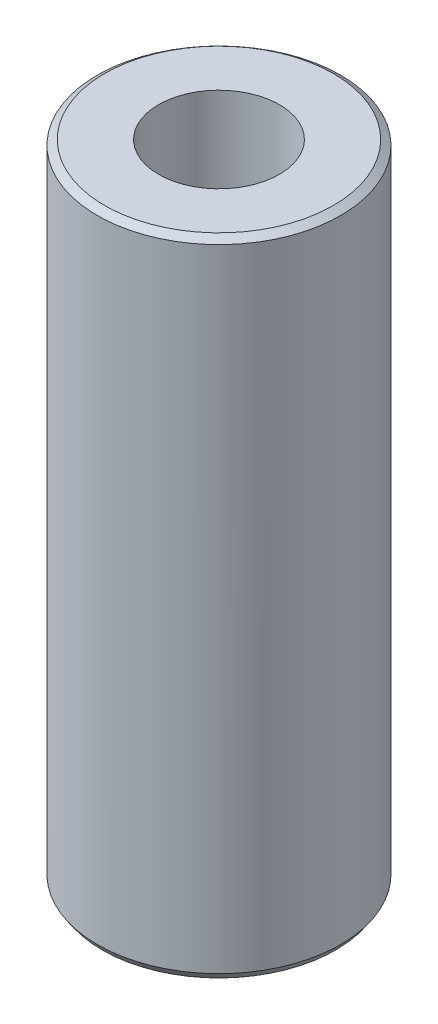
ISO-10303-21;
HEADER;
FILE_DESCRIPTION(('STEP AP214'),'2;1');
FILE_NAME('part.step','',(''),(''),'','','');
FILE_SCHEMA(('AUTOMOTIVE_DESIGN { 1 0 10303 214 1 1 1 1 }'));
ENDSEC;
DATA;
#1=APPLICATION_CONTEXT('core data for automotive mechanical design processes');
#2=APPLICATION_PROTOCOL_DEFINITION('international standard','automotive_design',2000,#1);
#3=PRODUCT_CONTEXT('',#1,'mechanical');
#4=PRODUCT('Part','Part','',(#3));
#5=PRODUCT_RELATED_PRODUCT_CATEGORY('part','',(#4));
#6=PRODUCT_DEFINITION_FORMATION('','',#4);
#7=PRODUCT_DEFINITION_CONTEXT('part definition',#1,'design');
#8=PRODUCT_DEFINITION('design','',#6,#7);
#9=PRODUCT_DEFINITION_SHAPE('','',#8);
#10=(LENGTH_UNIT() NAMED_UNIT(*) SI_UNIT(.MILLI.,.METRE.));
#11=(NAMED_UNIT(*) PLANE_ANGLE_UNIT() SI_UNIT($,.RADIAN.));
#12=(NAMED_UNIT(*) SI_UNIT($,.STERADIAN.) SOLID_ANGLE_UNIT());
#13=UNCERTAINTY_MEASURE_WITH_UNIT(LENGTH_MEASURE(1.E-05),#10,'distance_accuracy_value','');
#14=(GEOMETRIC_REPRESENTATION_CONTEXT(3) GLOBAL_UNCERTAINTY_ASSIGNED_CONTEXT((#13)) GLOBAL_UNIT_ASSIGNED_CONTEXT((#10,
#11,#12)) REPRESENTATION_CONTEXT('',''));
#15=CARTESIAN_POINT('',(0.,0.,0.));
#16=DIRECTION('',(0.,0.,1.));
#17=DIRECTION('',(1.,0.,0.));
#18=AXIS2_PLACEMENT_3D('',#15,#16,#17);
#19=CARTESIAN_POINT('',(0.,26.4578086175618,0.));
#20=DIRECTION('',(0.,-1.,0.));
#21=DIRECTION('',(0.,0.,-1.));
#22=AXIS2_PLACEMENT_3D('',#19,#20,#21);
#23=CYLINDRICAL_SURFACE('',#22,5.);
#24=CARTESIAN_POINT('',(0.,26.2505846226853,0.));
#25=DIRECTION('',(0.,1.,0.));
#26=DIRECTION('',(0.,0.,1.));
#27=AXIS2_PLACEMENT_3D('',#24,#25,#26);
#28=CIRCLE('',#27,5.);
#29=CARTESIAN_POINT('',(0.,26.2505846226853,-5.));
#30=VERTEX_POINT('',#29);
#31=EDGE_CURVE('E50',#30,#30,#28,.F.);
#32=ORIENTED_EDGE('',*,*,#31,.T.);
#33=EDGE_LOOP('',(#32));
#34=FACE_BOUND('',#33,.T.);
#35=CARTESIAN_POINT('',(0.,0.299683460139807,0.));
#36=DIRECTION('',(0.,1.,0.));
#37=DIRECTION('',(0.,0.,1.));
#38=AXIS2_PLACEMENT_3D('',#35,#36,#37);
#39=CIRCLE('',#38,5.);
#40=CARTESIAN_POINT('',(0.,0.299683460139807,5.));
#41=VERTEX_POINT('',#40);
#42=EDGE_CURVE('E51',#41,#41,#39,.T.);
#43=ORIENTED_EDGE('',*,*,#42,.T.);
#44=EDGE_LOOP('',(#43));
#45=FACE_BOUND('',#44,.T.);
#46=ADVANCED_FACE('F39',(#34,#45),#23,.T.);
#47=CARTESIAN_POINT('',(0.,26.4578086175618,0.));
#48=DIRECTION('',(0.,1.,0.));
#49=DIRECTION('',(0.,0.,1.));
#50=AXIS2_PLACEMENT_3D('',#47,#48,#49);
#51=PLANE('',#50);
#52=CARTESIAN_POINT('',(0.,26.4578086175618,0.));
#53=DIRECTION('',(0.,1.,0.));
#54=DIRECTION('',(0.,0.,1.));
#55=AXIS2_PLACEMENT_3D('',#52,#53,#54);
#56=CIRCLE('',#55,4.70031653986019);
#57=CARTESIAN_POINT('',(0.,26.4578086175618,-4.70031653986019));
#58=VERTEX_POINT('',#57);
#59=EDGE_CURVE('E54',#58,#58,#56,.T.);
#60=ORIENTED_EDGE('',*,*,#59,.T.);
#61=EDGE_LOOP('',(#60));
#62=FACE_BOUND('',#61,.T.);
#63=CARTESIAN_POINT('',(0.,26.4578086175618,0.));
#64=DIRECTION('',(0.,1.,0.));
#65=DIRECTION('',(0.,0.,1.));
#66=AXIS2_PLACEMENT_3D('',#63,#64,#65);
#67=CIRCLE('',#66,2.48332849350975);
#68=CARTESIAN_POINT('',(0.,26.4578086175618,2.48332849350975));
#69=VERTEX_POINT('',#68);
#70=EDGE_CURVE('E58',#69,#69,#67,.T.);
#71=ORIENTED_EDGE('',*,*,#70,.F.);
#72=EDGE_LOOP('',(#71));
#73=FACE_BOUND('',#72,.T.);
#74=ADVANCED_FACE('F69',(#62,#73),#51,.T.);
#75=CARTESIAN_POINT('',(0.,0.,0.));
#76=DIRECTION('',(0.,1.,0.));
#77=DIRECTION('',(0.,0.,1.));
#78=AXIS2_PLACEMENT_3D('',#75,#76,#77);
#79=PLANE('',#78);
#80=CARTESIAN_POINT('',(0.,0.,0.));
#81=DIRECTION('',(0.,1.,0.));
#82=DIRECTION('',(0.,0.,1.));
#83=AXIS2_PLACEMENT_3D('',#80,#81,#82);
#84=CIRCLE('',#83,4.79277600512346);
#85=CARTESIAN_POINT('',(0.,0.,4.79277600512346));
#86=VERTEX_POINT('',#85);
#87=EDGE_CURVE('E10',#86,#86,#84,.F.);
#88=ORIENTED_EDGE('',*,*,#87,.T.);
#89=EDGE_LOOP('',(#88));
#90=FACE_BOUND('',#89,.T.);
#91=CARTESIAN_POINT('',(0.,0.,0.));
#92=DIRECTION('',(0.,1.,0.));
#93=DIRECTION('',(0.,0.,1.));
#94=AXIS2_PLACEMENT_3D('',#91,#92,#93);
#95=CIRCLE('',#94,2.48332849350975);
#96=CARTESIAN_POINT('',(0.,0.,2.48332849350975));
#97=VERTEX_POINT('',#96);
#98=EDGE_CURVE('E63',#97,#97,#95,.T.);
#99=ORIENTED_EDGE('',*,*,#98,.T.);
#100=EDGE_LOOP('',(#99));
#101=FACE_BOUND('',#100,.T.);
#102=ADVANCED_FACE('F75',(#90,#101),#79,.F.);
#103=CARTESIAN_POINT('',(0.,26.4578086175618,0.));
#104=DIRECTION('',(0.,-1.,0.));
#105=DIRECTION('',(0.,0.,-1.));
#106=AXIS2_PLACEMENT_3D('',#103,#104,#105);
#107=CYLINDRICAL_SURFACE('',#106,2.48332849350975);
#108=ORIENTED_EDGE('',*,*,#70,.T.);
#109=EDGE_LOOP('',(#108));
#110=FACE_BOUND('',#109,.T.);
#111=ORIENTED_EDGE('',*,*,#98,.F.);
#112=EDGE_LOOP('',(#111));
#113=FACE_BOUND('',#112,.T.);
#114=ADVANCED_FACE('F70',(#110,#113),#107,.F.);
#115=CARTESIAN_POINT('',(0.,26.4578086175618,0.));
#116=DIRECTION('',(0.,-1.,0.));
#117=DIRECTION('',(0.,0.,-1.));
#118=AXIS2_PLACEMENT_3D('',#115,#116,#117);
#119=CONICAL_SURFACE('',#118,4.70031653986019,0.965813937660193);
#120=CARTESIAN_POINT('',(0.,26.2505846226853,-5.));
#121=CARTESIAN_POINT('',(0.,26.2527432059652,-4.99687829729021));
#122=CARTESIAN_POINT('',(0.,26.2549017892452,-4.99375659458042));
#123=CARTESIAN_POINT('',(0.,26.2592189558051,-4.98751318916084));
#124=CARTESIAN_POINT('',(0.,26.2613775390851,-4.98439148645105));
#125=CARTESIAN_POINT('',(0.,26.265694705645,-4.97814808103147));
#126=CARTESIAN_POINT('',(0.,26.267853288925,-4.97502637832168));
#127=CARTESIAN_POINT('',(0.,26.2721704554849,-4.96878297290211));
#128=CARTESIAN_POINT('',(0.,26.2743290387649,-4.96566127019232));
#129=CARTESIAN_POINT('',(0.,26.2786462053248,-4.95941786477274));
#130=CARTESIAN_POINT('',(0.,26.2808047886048,-4.95629616206295));
#131=CARTESIAN_POINT('',(0.,26.2851219551647,-4.95005275664337));
#132=CARTESIAN_POINT('',(0.,26.2872805384446,-4.94693105393358));
#133=CARTESIAN_POINT('',(0.,26.2915977050046,-4.940687648514));
#134=CARTESIAN_POINT('',(0.,26.2937562882845,-4.93756594580421));
#135=CARTESIAN_POINT('',(0.,26.2980734548445,-4.93132254038463));
#136=CARTESIAN_POINT('',(0.,26.3002320381244,-4.92820083767484));
#137=CARTESIAN_POINT('',(0.,26.3045492046844,-4.92195743225526));
#138=CARTESIAN_POINT('',(0.,26.3067077879643,-4.91883572954547));
#139=CARTESIAN_POINT('',(0.,26.3110249545242,-4.91259232412589));
#140=CARTESIAN_POINT('',(0.,26.3131835378042,-4.9094706214161));
#141=CARTESIAN_POINT('',(0.,26.3175007043641,-4.90322721599652));
#142=CARTESIAN_POINT('',(0.,26.3196592876441,-4.90010551328673));
#143=CARTESIAN_POINT('',(0.,26.323976454204,-4.89386210786715));
#144=CARTESIAN_POINT('',(0.,26.326135037484,-4.89074040515736));
#145=CARTESIAN_POINT('',(0.,26.3304522040439,-4.88449699973778));
#146=CARTESIAN_POINT('',(0.,26.3326107873239,-4.88137529702799));
#147=CARTESIAN_POINT('',(0.,26.3369279538838,-4.87513189160842));
#148=CARTESIAN_POINT('',(0.,26.3390865371638,-4.87201018889863));
#149=CARTESIAN_POINT('',(0.,26.3434037037237,-4.86576678347905));
#150=CARTESIAN_POINT('',(0.,26.3455622870037,-4.86264508076926));
#151=CARTESIAN_POINT('',(0.,26.3498794535636,-4.85640167534968));
#152=CARTESIAN_POINT('',(0.,26.3520380368436,-4.85327997263989));
#153=CARTESIAN_POINT('',(0.,26.3563552034035,-4.84703656722031));
#154=CARTESIAN_POINT('',(0.,26.3585137866835,-4.84391486451052));
#155=CARTESIAN_POINT('',(0.,26.3628309532434,-4.83767145909094));
#156=CARTESIAN_POINT('',(0.,26.3649895365233,-4.83454975638115));
#157=CARTESIAN_POINT('',(0.,26.3693067030833,-4.82830635096157));
#158=CARTESIAN_POINT('',(0.,26.3714652863632,-4.82518464825178));
#159=CARTESIAN_POINT('',(0.,26.3757824529232,-4.8189412428322));
#160=CARTESIAN_POINT('',(0.,26.3779410362031,-4.81581954012241));
#161=CARTESIAN_POINT('',(0.,26.3822582027631,-4.80957613470283));
#162=CARTESIAN_POINT('',(0.,26.384416786043,-4.80645443199304));
#163=CARTESIAN_POINT('',(0.,26.388733952603,-4.80021102657346));
#164=CARTESIAN_POINT('',(0.,26.3908925358829,-4.79708932386367));
#165=CARTESIAN_POINT('',(0.,26.3952097024428,-4.79084591844409));
#166=CARTESIAN_POINT('',(0.,26.3973682857228,-4.7877242157343));
#167=CARTESIAN_POINT('',(0.,26.4016854522827,-4.78148081031473));
#168=CARTESIAN_POINT('',(0.,26.4038440355627,-4.77835910760494));
#169=CARTESIAN_POINT('',(0.,26.4081612021226,-4.77211570218536));
#170=CARTESIAN_POINT('',(0.,26.4103197854026,-4.76899399947557));
#171=CARTESIAN_POINT('',(0.,26.4146369519625,-4.76275059405599));
#172=CARTESIAN_POINT('',(0.,26.4167955352425,-4.7596288913462));
#173=CARTESIAN_POINT('',(0.,26.4211127018024,-4.75338548592662));
#174=CARTESIAN_POINT('',(0.,26.4232712850824,-4.75026378321683));
#175=CARTESIAN_POINT('',(0.,26.4275884516423,-4.74402037779725));
#176=CARTESIAN_POINT('',(0.,26.4297470349223,-4.74089867508746));
#177=CARTESIAN_POINT('',(0.,26.4340642014822,-4.73465526966788));
#178=CARTESIAN_POINT('',(0.,26.4362227847622,-4.73153356695809));
#179=CARTESIAN_POINT('',(0.,26.4405399513221,-4.72529016153851));
#180=CARTESIAN_POINT('',(0.,26.4426985346021,-4.72216845882872));
#181=CARTESIAN_POINT('',(0.,26.447015701162,-4.71592505340914));
#182=CARTESIAN_POINT('',(0.,26.4491742844419,-4.71280335069935));
#183=CARTESIAN_POINT('',(0.,26.4534914510019,-4.70655994527977));
#184=CARTESIAN_POINT('',(0.,26.4556500342818,-4.70343824256998));
#185=CARTESIAN_POINT('',(0.,26.4578086175618,-4.70031653986019));
#186=B_SPLINE_CURVE_WITH_KNOTS('',3,(#120,#121,#122,#123,#124,#125,#126,#127,#128,#129,#130,
#131,#132,#133,#134,#135,#136,#137,#138,#139,#140,#141,#142,#143,#144,#145,#146,#147,#148,#149,
#150,#151,#152,#153,#154,#155,#156,#157,#158,#159,#160,#161,#162,#163,#164,#165,#166,#167,#168,
#169,#170,#171,#172,#173,#174,#175,#176,#177,#178,#179,#180,#181,#182,#183,#184,#185),
.UNSPECIFIED.,.F.,.F.,(4,2,2,2,2,2,2,2,2,2,2,2,2,2,2,2,2,2,2,2,2,2,2,2,2,2,2,2,2,2,2,2,4),(0.,
0.0113859820069951,0.0227719640139901,0.0341579460209872,0.0455439280279822,0.0569299100349792,
0.0683158920419743,0.0797018740489713,0.0910878560559664,0.102473838062961,0.113859820069958,
0.125245802076954,0.136631784083951,0.148017766090946,0.159403748097943,0.170789730104938,
0.182175712111935,0.19356169411893,0.204947676125925,0.216333658132922,0.227719640139916,
0.239105622146913,0.250491604153908,0.261877586160905,0.2732635681679,0.284649550174895,
0.296035532181892,0.307421514188888,0.318807496195885,0.33019347820288,0.341579460209877,
0.352965442216872,0.364351424223869),.UNSPECIFIED.);
#187=EDGE_CURVE('BSEAM81',#30,#58,#186,.T.);
#188=ORIENTED_EDGE('',*,*,#31,.F.);
#189=ORIENTED_EDGE('',*,*,#59,.F.);
#190=ORIENTED_EDGE('',*,*,#187,.T.);
#191=ORIENTED_EDGE('',*,*,#187,.F.);
#192=EDGE_LOOP('',(#188,#190,#189,#191));
#193=FACE_BOUND('',#192,.T.);
#194=ADVANCED_FACE('F81',(#193),#119,.T.);
#195=CARTESIAN_POINT('',(0.,0.299683460139807,0.));
#196=DIRECTION('',(0.,1.,0.));
#197=DIRECTION('',(0.,0.,1.));
#198=AXIS2_PLACEMENT_3D('',#195,#196,#197);
#199=CONICAL_SURFACE('',#198,5.,0.604982389134706);
#200=ORIENTED_EDGE('',*,*,#87,.F.);
#201=EDGE_LOOP('',(#200));
#202=FACE_BOUND('',#201,.T.);
#203=ORIENTED_EDGE('',*,*,#42,.F.);
#204=EDGE_LOOP('',(#203));
#205=FACE_BOUND('',#204,.T.);
#206=ADVANCED_FACE('F45',(#202,#205),#199,.T.);
#207=CLOSED_SHELL('',(#46,#74,#102,#114,#194,#206));
#208=MANIFOLD_SOLID_BREP('B2',#207);
#209=ADVANCED_BREP_SHAPE_REPRESENTATION('',(#18,#208),#14);
#210=SHAPE_DEFINITION_REPRESENTATION(#9,#209);
ENDSEC;
END-ISO-10303-21;
